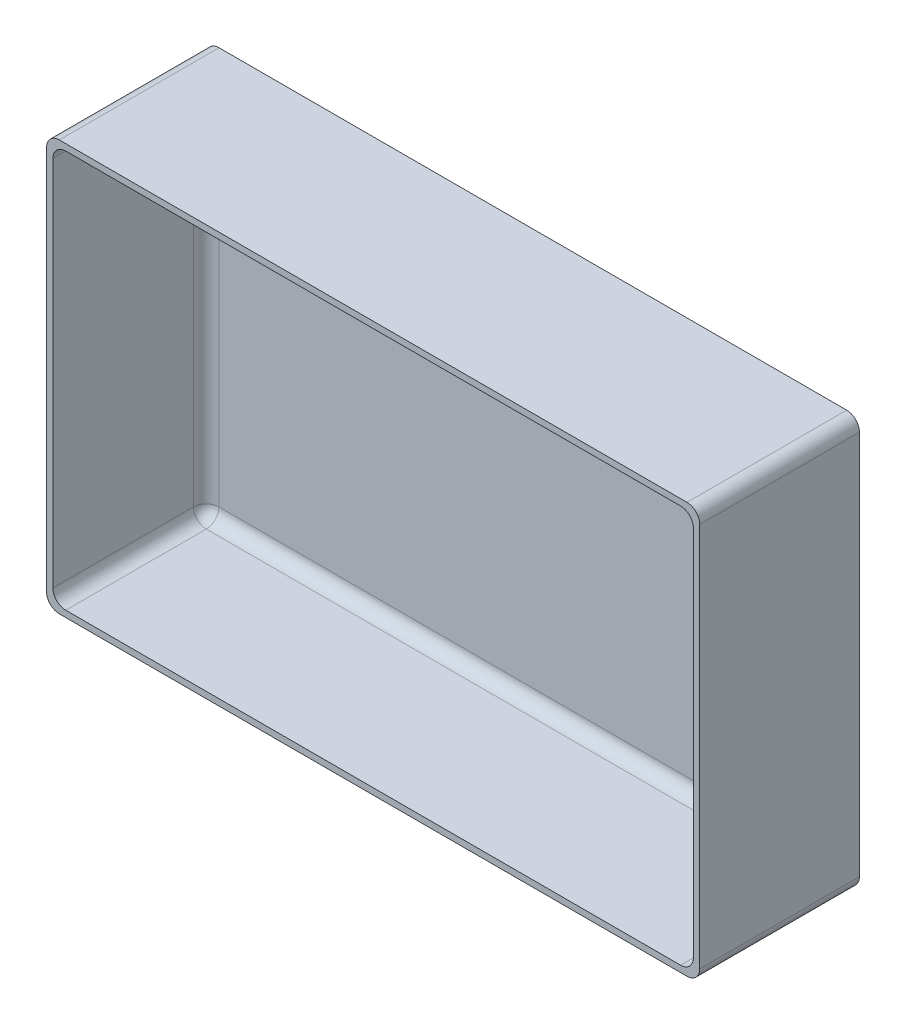
ISO-10303-21;
HEADER;
FILE_DESCRIPTION(('STEP AP214'),'2;1');
FILE_NAME('part.step','',(''),(''),'','','');
FILE_SCHEMA(('AUTOMOTIVE_DESIGN { 1 0 10303 214 1 1 1 1 }'));
ENDSEC;
DATA;
#1=APPLICATION_CONTEXT('core data for automotive mechanical design processes');
#2=APPLICATION_PROTOCOL_DEFINITION('international standard','automotive_design',2000,#1);
#3=PRODUCT_CONTEXT('',#1,'mechanical');
#4=PRODUCT('Part','Part','',(#3));
#5=PRODUCT_RELATED_PRODUCT_CATEGORY('part','',(#4));
#6=PRODUCT_DEFINITION_FORMATION('','',#4);
#7=PRODUCT_DEFINITION_CONTEXT('part definition',#1,'design');
#8=PRODUCT_DEFINITION('design','',#6,#7);
#9=PRODUCT_DEFINITION_SHAPE('','',#8);
#10=(LENGTH_UNIT() NAMED_UNIT(*) SI_UNIT(.MILLI.,.METRE.));
#11=(NAMED_UNIT(*) PLANE_ANGLE_UNIT() SI_UNIT($,.RADIAN.));
#12=(NAMED_UNIT(*) SI_UNIT($,.STERADIAN.) SOLID_ANGLE_UNIT());
#13=UNCERTAINTY_MEASURE_WITH_UNIT(LENGTH_MEASURE(1.E-05),#10,'distance_accuracy_value','');
#14=(GEOMETRIC_REPRESENTATION_CONTEXT(3) GLOBAL_UNCERTAINTY_ASSIGNED_CONTEXT((#13)) GLOBAL_UNIT_ASSIGNED_CONTEXT((#10,
#11,#12)) REPRESENTATION_CONTEXT('',''));
#15=CARTESIAN_POINT('',(0.,0.,0.));
#16=DIRECTION('',(0.,0.,1.));
#17=DIRECTION('',(1.,0.,0.));
#18=AXIS2_PLACEMENT_3D('',#15,#16,#17);
#19=CARTESIAN_POINT('',(40.9,25.7,20.));
#20=DIRECTION('',(-1.,0.,0.));
#21=DIRECTION('',(0.,0.,1.));
#22=AXIS2_PLACEMENT_3D('',#19,#20,#21);
#23=PLANE('',#22);
#24=DIRECTION('',(0.,1.,0.));
#25=VECTOR('',#24,1.);
#26=CARTESIAN_POINT('',(40.9,25.7,20.));
#27=LINE('',#26,#25);
#28=CARTESIAN_POINT('',(40.9,-24.1,20.));
#29=VERTEX_POINT('',#28);
#30=CARTESIAN_POINT('',(40.9,24.1,20.));
#31=VERTEX_POINT('',#30);
#32=EDGE_CURVE('E178',#29,#31,#27,.T.);
#33=ORIENTED_EDGE('',*,*,#32,.F.);
#34=DIRECTION('',(0.,0.,-1.));
#35=VECTOR('',#34,1.);
#36=CARTESIAN_POINT('',(40.9,-24.1,20.));
#37=LINE('',#36,#35);
#38=CARTESIAN_POINT('',(40.9,-24.1,0.));
#39=VERTEX_POINT('',#38);
#40=EDGE_CURVE('E163',#29,#39,#37,.T.);
#41=ORIENTED_EDGE('',*,*,#40,.T.);
#42=DIRECTION('',(0.,1.,0.));
#43=VECTOR('',#42,1.);
#44=CARTESIAN_POINT('',(40.9,25.7,0.));
#45=LINE('',#44,#43);
#46=CARTESIAN_POINT('',(40.9,24.1,0.));
#47=VERTEX_POINT('',#46);
#48=EDGE_CURVE('E175',#39,#47,#45,.T.);
#49=ORIENTED_EDGE('',*,*,#48,.T.);
#50=DIRECTION('',(0.,0.,-1.));
#51=VECTOR('',#50,1.);
#52=CARTESIAN_POINT('',(40.9,24.1,20.));
#53=LINE('',#52,#51);
#54=EDGE_CURVE('E180',#47,#31,#53,.F.);
#55=ORIENTED_EDGE('',*,*,#54,.T.);
#56=EDGE_LOOP('',(#33,#41,#49,#55));
#57=FACE_BOUND('',#56,.T.);
#58=ADVANCED_FACE('F33',(#57),#23,.F.);
#59=CARTESIAN_POINT('',(-40.9,25.7,20.));
#60=DIRECTION('',(0.,-1.,0.));
#61=DIRECTION('',(0.,0.,-1.));
#62=AXIS2_PLACEMENT_3D('',#59,#60,#61);
#63=PLANE('',#62);
#64=DIRECTION('',(-1.,0.,0.));
#65=VECTOR('',#64,1.);
#66=CARTESIAN_POINT('',(-40.9,25.7,0.));
#67=LINE('',#66,#65);
#68=CARTESIAN_POINT('',(39.3,25.7,0.));
#69=VERTEX_POINT('',#68);
#70=CARTESIAN_POINT('',(-39.3,25.7,0.));
#71=VERTEX_POINT('',#70);
#72=EDGE_CURVE('E185',#69,#71,#67,.T.);
#73=ORIENTED_EDGE('',*,*,#72,.T.);
#74=DIRECTION('',(0.,0.,-1.));
#75=VECTOR('',#74,1.);
#76=CARTESIAN_POINT('',(-39.3,25.7,20.));
#77=LINE('',#76,#75);
#78=CARTESIAN_POINT('',(-39.3,25.7,20.));
#79=VERTEX_POINT('',#78);
#80=EDGE_CURVE('E225',#71,#79,#77,.F.);
#81=ORIENTED_EDGE('',*,*,#80,.T.);
#82=DIRECTION('',(-1.,0.,0.));
#83=VECTOR('',#82,1.);
#84=CARTESIAN_POINT('',(-40.9,25.7,20.));
#85=LINE('',#84,#83);
#86=CARTESIAN_POINT('',(39.3,25.7,20.));
#87=VERTEX_POINT('',#86);
#88=EDGE_CURVE('E310',#87,#79,#85,.T.);
#89=ORIENTED_EDGE('',*,*,#88,.F.);
#90=DIRECTION('',(0.,0.,-1.));
#91=VECTOR('',#90,1.);
#92=CARTESIAN_POINT('',(39.3,25.7,20.));
#93=LINE('',#92,#91);
#94=EDGE_CURVE('E222',#87,#69,#93,.T.);
#95=ORIENTED_EDGE('',*,*,#94,.T.);
#96=EDGE_LOOP('',(#73,#81,#89,#95));
#97=FACE_BOUND('',#96,.T.);
#98=ADVANCED_FACE('F335',(#97),#63,.F.);
#99=CARTESIAN_POINT('',(-40.9,25.7,20.));
#100=DIRECTION('',(1.,0.,0.));
#101=DIRECTION('',(0.,1.,0.));
#102=AXIS2_PLACEMENT_3D('',#99,#100,#101);
#103=PLANE('',#102);
#104=DIRECTION('',(0.,-1.,0.));
#105=VECTOR('',#104,1.);
#106=CARTESIAN_POINT('',(-40.9,25.7,20.));
#107=LINE('',#106,#105);
#108=CARTESIAN_POINT('',(-40.9,24.1,20.));
#109=VERTEX_POINT('',#108);
#110=CARTESIAN_POINT('',(-40.9,-24.1,20.));
#111=VERTEX_POINT('',#110);
#112=EDGE_CURVE('E312',#109,#111,#107,.T.);
#113=ORIENTED_EDGE('',*,*,#112,.F.);
#114=DIRECTION('',(0.,0.,-1.));
#115=VECTOR('',#114,1.);
#116=CARTESIAN_POINT('',(-40.9,24.1,20.));
#117=LINE('',#116,#115);
#118=CARTESIAN_POINT('',(-40.9,24.1,0.));
#119=VERTEX_POINT('',#118);
#120=EDGE_CURVE('E219',#109,#119,#117,.T.);
#121=ORIENTED_EDGE('',*,*,#120,.T.);
#122=DIRECTION('',(0.,-1.,0.));
#123=VECTOR('',#122,1.);
#124=CARTESIAN_POINT('',(-40.9,25.7,0.));
#125=LINE('',#124,#123);
#126=CARTESIAN_POINT('',(-40.9,-24.1,0.));
#127=VERTEX_POINT('',#126);
#128=EDGE_CURVE('E189',#119,#127,#125,.T.);
#129=ORIENTED_EDGE('',*,*,#128,.T.);
#130=DIRECTION('',(0.,0.,-1.));
#131=VECTOR('',#130,1.);
#132=CARTESIAN_POINT('',(-40.9,-24.1,20.));
#133=LINE('',#132,#131);
#134=EDGE_CURVE('E217',#127,#111,#133,.F.);
#135=ORIENTED_EDGE('',*,*,#134,.T.);
#136=EDGE_LOOP('',(#113,#121,#129,#135));
#137=FACE_BOUND('',#136,.T.);
#138=ADVANCED_FACE('F328',(#137),#103,.F.);
#139=CARTESIAN_POINT('',(-40.9,-25.7,20.));
#140=DIRECTION('',(0.,1.,0.));
#141=DIRECTION('',(0.,0.,1.));
#142=AXIS2_PLACEMENT_3D('',#139,#140,#141);
#143=PLANE('',#142);
#144=DIRECTION('',(1.,0.,0.));
#145=VECTOR('',#144,1.);
#146=CARTESIAN_POINT('',(-40.9,-25.7,0.));
#147=LINE('',#146,#145);
#148=CARTESIAN_POINT('',(-39.3,-25.7,0.));
#149=VERTEX_POINT('',#148);
#150=CARTESIAN_POINT('',(39.3,-25.7,0.));
#151=VERTEX_POINT('',#150);
#152=EDGE_CURVE('E200',#149,#151,#147,.T.);
#153=ORIENTED_EDGE('',*,*,#152,.T.);
#154=DIRECTION('',(0.,0.,-1.));
#155=VECTOR('',#154,1.);
#156=CARTESIAN_POINT('',(39.3,-25.7,20.));
#157=LINE('',#156,#155);
#158=CARTESIAN_POINT('',(39.3,-25.7,20.));
#159=VERTEX_POINT('',#158);
#160=EDGE_CURVE('E164',#151,#159,#157,.F.);
#161=ORIENTED_EDGE('',*,*,#160,.T.);
#162=DIRECTION('',(1.,0.,0.));
#163=VECTOR('',#162,1.);
#164=CARTESIAN_POINT('',(-40.9,-25.7,20.));
#165=LINE('',#164,#163);
#166=CARTESIAN_POINT('',(-39.3,-25.7,20.));
#167=VERTEX_POINT('',#166);
#168=EDGE_CURVE('E195',#167,#159,#165,.T.);
#169=ORIENTED_EDGE('',*,*,#168,.F.);
#170=DIRECTION('',(0.,0.,-1.));
#171=VECTOR('',#170,1.);
#172=CARTESIAN_POINT('',(-39.3,-25.7,20.));
#173=LINE('',#172,#171);
#174=EDGE_CURVE('E169',#167,#149,#173,.T.);
#175=ORIENTED_EDGE('',*,*,#174,.T.);
#176=EDGE_LOOP('',(#153,#161,#169,#175));
#177=FACE_BOUND('',#176,.T.);
#178=ADVANCED_FACE('F322',(#177),#143,.F.);
#179=CARTESIAN_POINT('',(0.,0.,20.));
#180=DIRECTION('',(0.,0.,1.));
#181=DIRECTION('',(1.,0.,0.));
#182=AXIS2_PLACEMENT_3D('',#179,#180,#181);
#183=PLANE('',#182);
#184=DIRECTION('',(0.,1.,0.));
#185=VECTOR('',#184,1.);
#186=CARTESIAN_POINT('',(40.1,25.7,20.));
#187=LINE('',#186,#185);
#188=CARTESIAN_POINT('',(40.1,-23.3,20.));
#189=VERTEX_POINT('',#188);
#190=CARTESIAN_POINT('',(40.1,23.3,20.));
#191=VERTEX_POINT('',#190);
#192=EDGE_CURVE('E297',#189,#191,#187,.T.);
#193=ORIENTED_EDGE('',*,*,#192,.F.);
#194=CARTESIAN_POINT('',(38.5,-23.3,20.));
#195=DIRECTION('',(0.,0.,1.));
#196=DIRECTION('',(1.,0.,0.));
#197=AXIS2_PLACEMENT_3D('',#194,#195,#196);
#198=CIRCLE('',#197,1.6);
#199=CARTESIAN_POINT('',(38.5,-24.9,20.));
#200=VERTEX_POINT('',#199);
#201=EDGE_CURVE('E259',#189,#200,#198,.F.);
#202=ORIENTED_EDGE('',*,*,#201,.T.);
#203=DIRECTION('',(1.,0.,0.));
#204=VECTOR('',#203,1.);
#205=CARTESIAN_POINT('',(-40.9,-24.9,20.));
#206=LINE('',#205,#204);
#207=CARTESIAN_POINT('',(-38.5,-24.9,20.));
#208=VERTEX_POINT('',#207);
#209=EDGE_CURVE('E186',#208,#200,#206,.T.);
#210=ORIENTED_EDGE('',*,*,#209,.F.);
#211=CARTESIAN_POINT('',(-38.5,-23.3,20.));
#212=DIRECTION('',(0.,0.,1.));
#213=DIRECTION('',(1.,0.,0.));
#214=AXIS2_PLACEMENT_3D('',#211,#212,#213);
#215=CIRCLE('',#214,1.6);
#216=CARTESIAN_POINT('',(-40.1,-23.3,20.));
#217=VERTEX_POINT('',#216);
#218=EDGE_CURVE('E261',#208,#217,#215,.F.);
#219=ORIENTED_EDGE('',*,*,#218,.T.);
#220=DIRECTION('',(0.,-1.,0.));
#221=VECTOR('',#220,1.);
#222=CARTESIAN_POINT('',(-40.1,25.7,20.));
#223=LINE('',#222,#221);
#224=CARTESIAN_POINT('',(-40.1,23.3,20.));
#225=VERTEX_POINT('',#224);
#226=EDGE_CURVE('E192',#225,#217,#223,.T.);
#227=ORIENTED_EDGE('',*,*,#226,.F.);
#228=CARTESIAN_POINT('',(-38.5,23.3,20.));
#229=DIRECTION('',(0.,0.,1.));
#230=DIRECTION('',(1.,0.,0.));
#231=AXIS2_PLACEMENT_3D('',#228,#229,#230);
#232=CIRCLE('',#231,1.6);
#233=CARTESIAN_POINT('',(-38.5,24.9,20.));
#234=VERTEX_POINT('',#233);
#235=EDGE_CURVE('E11',#225,#234,#232,.F.);
#236=ORIENTED_EDGE('',*,*,#235,.T.);
#237=DIRECTION('',(-1.,0.,0.));
#238=VECTOR('',#237,1.);
#239=CARTESIAN_POINT('',(-40.9,24.9,20.));
#240=LINE('',#239,#238);
#241=CARTESIAN_POINT('',(38.5,24.9,20.));
#242=VERTEX_POINT('',#241);
#243=EDGE_CURVE('E300',#242,#234,#240,.T.);
#244=ORIENTED_EDGE('',*,*,#243,.F.);
#245=CARTESIAN_POINT('',(38.5,23.3,20.));
#246=DIRECTION('',(0.,0.,1.));
#247=DIRECTION('',(1.,0.,0.));
#248=AXIS2_PLACEMENT_3D('',#245,#246,#247);
#249=CIRCLE('',#248,1.6);
#250=EDGE_CURVE('E42',#242,#191,#249,.F.);
#251=ORIENTED_EDGE('',*,*,#250,.T.);
#252=EDGE_LOOP('',(#193,#202,#210,#219,#227,#236,#244,#251));
#253=FACE_BOUND('',#252,.T.);
#254=ORIENTED_EDGE('',*,*,#168,.T.);
#255=CARTESIAN_POINT('',(39.3,-24.1,20.));
#256=DIRECTION('',(0.,0.,1.));
#257=DIRECTION('',(1.,0.,0.));
#258=AXIS2_PLACEMENT_3D('',#255,#256,#257);
#259=CIRCLE('',#258,1.6);
#260=EDGE_CURVE('E215',#159,#29,#259,.T.);
#261=ORIENTED_EDGE('',*,*,#260,.T.);
#262=ORIENTED_EDGE('',*,*,#32,.T.);
#263=CARTESIAN_POINT('',(39.3,24.1,20.));
#264=DIRECTION('',(0.,0.,1.));
#265=DIRECTION('',(1.,0.,0.));
#266=AXIS2_PLACEMENT_3D('',#263,#264,#265);
#267=CIRCLE('',#266,1.6);
#268=EDGE_CURVE('E211',#31,#87,#267,.T.);
#269=ORIENTED_EDGE('',*,*,#268,.T.);
#270=ORIENTED_EDGE('',*,*,#88,.T.);
#271=CARTESIAN_POINT('',(-39.3,24.1,20.));
#272=DIRECTION('',(0.,0.,1.));
#273=DIRECTION('',(1.,0.,0.));
#274=AXIS2_PLACEMENT_3D('',#271,#272,#273);
#275=CIRCLE('',#274,1.6);
#276=EDGE_CURVE('E213',#79,#109,#275,.T.);
#277=ORIENTED_EDGE('',*,*,#276,.T.);
#278=ORIENTED_EDGE('',*,*,#112,.T.);
#279=CARTESIAN_POINT('',(-39.3,-24.1,20.));
#280=DIRECTION('',(0.,0.,1.));
#281=DIRECTION('',(1.,0.,0.));
#282=AXIS2_PLACEMENT_3D('',#279,#280,#281);
#283=CIRCLE('',#282,1.6);
#284=EDGE_CURVE('E209',#111,#167,#283,.T.);
#285=ORIENTED_EDGE('',*,*,#284,.T.);
#286=EDGE_LOOP('',(#254,#261,#262,#269,#270,#277,#278,#285));
#287=FACE_BOUND('',#286,.T.);
#288=ADVANCED_FACE('F319',(#253,#287),#183,.T.);
#289=CARTESIAN_POINT('',(0.,0.,0.));
#290=DIRECTION('',(0.,0.,1.));
#291=DIRECTION('',(1.,0.,0.));
#292=AXIS2_PLACEMENT_3D('',#289,#290,#291);
#293=PLANE('',#292);
#294=ORIENTED_EDGE('',*,*,#48,.F.);
#295=CARTESIAN_POINT('',(39.3,-24.1,0.));
#296=DIRECTION('',(0.,0.,1.));
#297=DIRECTION('',(1.,0.,0.));
#298=AXIS2_PLACEMENT_3D('',#295,#296,#297);
#299=CIRCLE('',#298,1.6);
#300=EDGE_CURVE('E159',#39,#151,#299,.F.);
#301=ORIENTED_EDGE('',*,*,#300,.T.);
#302=ORIENTED_EDGE('',*,*,#152,.F.);
#303=CARTESIAN_POINT('',(-39.3,-24.1,0.));
#304=DIRECTION('',(0.,0.,1.));
#305=DIRECTION('',(1.,0.,0.));
#306=AXIS2_PLACEMENT_3D('',#303,#304,#305);
#307=CIRCLE('',#306,1.6);
#308=EDGE_CURVE('E179',#149,#127,#307,.F.);
#309=ORIENTED_EDGE('',*,*,#308,.T.);
#310=ORIENTED_EDGE('',*,*,#128,.F.);
#311=CARTESIAN_POINT('',(-39.3,24.1,0.));
#312=DIRECTION('',(0.,0.,1.));
#313=DIRECTION('',(1.,0.,0.));
#314=AXIS2_PLACEMENT_3D('',#311,#312,#313);
#315=CIRCLE('',#314,1.6);
#316=EDGE_CURVE('E170',#119,#71,#315,.F.);
#317=ORIENTED_EDGE('',*,*,#316,.T.);
#318=ORIENTED_EDGE('',*,*,#72,.F.);
#319=CARTESIAN_POINT('',(39.3,24.1,0.));
#320=DIRECTION('',(0.,0.,1.));
#321=DIRECTION('',(1.,0.,0.));
#322=AXIS2_PLACEMENT_3D('',#319,#320,#321);
#323=CIRCLE('',#322,1.6);
#324=EDGE_CURVE('E184',#69,#47,#323,.F.);
#325=ORIENTED_EDGE('',*,*,#324,.T.);
#326=EDGE_LOOP('',(#294,#301,#302,#309,#310,#317,#318,#325));
#327=FACE_BOUND('',#326,.T.);
#328=ADVANCED_FACE('F182',(#327),#293,.F.);
#329=CARTESIAN_POINT('',(40.1,25.7,20.));
#330=DIRECTION('',(-1.,0.,0.));
#331=DIRECTION('',(0.,0.,1.));
#332=AXIS2_PLACEMENT_3D('',#329,#330,#331);
#333=PLANE('',#332);
#334=DIRECTION('',(0.,1.,0.));
#335=VECTOR('',#334,1.);
#336=CARTESIAN_POINT('',(40.1,-24.9,2.4));
#337=LINE('',#336,#335);
#338=CARTESIAN_POINT('',(40.1,23.3,2.4));
#339=VERTEX_POINT('',#338);
#340=CARTESIAN_POINT('',(40.1,-23.3,2.4));
#341=VERTEX_POINT('',#340);
#342=EDGE_CURVE('E238',#339,#341,#337,.F.);
#343=ORIENTED_EDGE('',*,*,#342,.T.);
#344=DIRECTION('',(0.,0.,-1.));
#345=VECTOR('',#344,1.);
#346=CARTESIAN_POINT('',(40.1,-23.3,20.));
#347=LINE('',#346,#345);
#348=EDGE_CURVE('E241',#341,#189,#347,.F.);
#349=ORIENTED_EDGE('',*,*,#348,.T.);
#350=ORIENTED_EDGE('',*,*,#192,.T.);
#351=DIRECTION('',(0.,0.,-1.));
#352=VECTOR('',#351,1.);
#353=CARTESIAN_POINT('',(40.1,23.3,0.799999999999999));
#354=LINE('',#353,#352);
#355=EDGE_CURVE('E236',#191,#339,#354,.T.);
#356=ORIENTED_EDGE('',*,*,#355,.T.);
#357=EDGE_LOOP('',(#343,#349,#350,#356));
#358=FACE_BOUND('',#357,.T.);
#359=ADVANCED_FACE('F378',(#358),#333,.T.);
#360=CARTESIAN_POINT('',(-40.9,24.9,20.));
#361=DIRECTION('',(0.,-1.,0.));
#362=DIRECTION('',(0.,0.,-1.));
#363=AXIS2_PLACEMENT_3D('',#360,#361,#362);
#364=PLANE('',#363);
#365=DIRECTION('',(-1.,0.,0.));
#366=VECTOR('',#365,1.);
#367=CARTESIAN_POINT('',(40.1,24.9,2.4));
#368=LINE('',#367,#366);
#369=CARTESIAN_POINT('',(-38.5,24.9,2.4));
#370=VERTEX_POINT('',#369);
#371=CARTESIAN_POINT('',(38.5,24.9,2.4));
#372=VERTEX_POINT('',#371);
#373=EDGE_CURVE('E50',#370,#372,#368,.F.);
#374=ORIENTED_EDGE('',*,*,#373,.T.);
#375=DIRECTION('',(0.,0.,-1.));
#376=VECTOR('',#375,1.);
#377=CARTESIAN_POINT('',(38.5,24.9,20.));
#378=LINE('',#377,#376);
#379=EDGE_CURVE('E257',#372,#242,#378,.F.);
#380=ORIENTED_EDGE('',*,*,#379,.T.);
#381=ORIENTED_EDGE('',*,*,#243,.T.);
#382=DIRECTION('',(0.,0.,-1.));
#383=VECTOR('',#382,1.);
#384=CARTESIAN_POINT('',(-38.5,24.9,0.799999999999999));
#385=LINE('',#384,#383);
#386=EDGE_CURVE('E55',#234,#370,#385,.T.);
#387=ORIENTED_EDGE('',*,*,#386,.T.);
#388=EDGE_LOOP('',(#374,#380,#381,#387));
#389=FACE_BOUND('',#388,.T.);
#390=ADVANCED_FACE('F403',(#389),#364,.T.);
#391=CARTESIAN_POINT('',(-40.1,25.7,20.));
#392=DIRECTION('',(1.,0.,0.));
#393=DIRECTION('',(0.,1.,0.));
#394=AXIS2_PLACEMENT_3D('',#391,#392,#393);
#395=PLANE('',#394);
#396=ORIENTED_EDGE('',*,*,#226,.T.);
#397=DIRECTION('',(0.,0.,-1.));
#398=VECTOR('',#397,1.);
#399=CARTESIAN_POINT('',(-40.1,-23.3,0.799999999999999));
#400=LINE('',#399,#398);
#401=CARTESIAN_POINT('',(-40.1,-23.3,2.4));
#402=VERTEX_POINT('',#401);
#403=EDGE_CURVE('E247',#217,#402,#400,.T.);
#404=ORIENTED_EDGE('',*,*,#403,.T.);
#405=DIRECTION('',(0.,-1.,0.));
#406=VECTOR('',#405,1.);
#407=CARTESIAN_POINT('',(-40.1,24.9,2.4));
#408=LINE('',#407,#406);
#409=CARTESIAN_POINT('',(-40.1,23.3,2.4));
#410=VERTEX_POINT('',#409);
#411=EDGE_CURVE('E245',#402,#410,#408,.F.);
#412=ORIENTED_EDGE('',*,*,#411,.T.);
#413=DIRECTION('',(0.,0.,-1.));
#414=VECTOR('',#413,1.);
#415=CARTESIAN_POINT('',(-40.1,23.3,20.));
#416=LINE('',#415,#414);
#417=EDGE_CURVE('E243',#410,#225,#416,.F.);
#418=ORIENTED_EDGE('',*,*,#417,.T.);
#419=EDGE_LOOP('',(#396,#404,#412,#418));
#420=FACE_BOUND('',#419,.T.);
#421=ADVANCED_FACE('F368',(#420),#395,.T.);
#422=CARTESIAN_POINT('',(-40.9,-24.9,20.));
#423=DIRECTION('',(0.,1.,0.));
#424=DIRECTION('',(0.,0.,1.));
#425=AXIS2_PLACEMENT_3D('',#422,#423,#424);
#426=PLANE('',#425);
#427=ORIENTED_EDGE('',*,*,#209,.T.);
#428=DIRECTION('',(0.,0.,-1.));
#429=VECTOR('',#428,1.);
#430=CARTESIAN_POINT('',(38.5,-24.9,0.799999999999999));
#431=LINE('',#430,#429);
#432=CARTESIAN_POINT('',(38.5,-24.9,2.4));
#433=VERTEX_POINT('',#432);
#434=EDGE_CURVE('E253',#200,#433,#431,.T.);
#435=ORIENTED_EDGE('',*,*,#434,.T.);
#436=DIRECTION('',(1.,0.,0.));
#437=VECTOR('',#436,1.);
#438=CARTESIAN_POINT('',(-40.1,-24.9,2.4));
#439=LINE('',#438,#437);
#440=CARTESIAN_POINT('',(-38.5,-24.9,2.4));
#441=VERTEX_POINT('',#440);
#442=EDGE_CURVE('E251',#433,#441,#439,.F.);
#443=ORIENTED_EDGE('',*,*,#442,.T.);
#444=DIRECTION('',(0.,0.,-1.));
#445=VECTOR('',#444,1.);
#446=CARTESIAN_POINT('',(-38.5,-24.9,20.));
#447=LINE('',#446,#445);
#448=EDGE_CURVE('E249',#441,#208,#447,.F.);
#449=ORIENTED_EDGE('',*,*,#448,.T.);
#450=EDGE_LOOP('',(#427,#435,#443,#449));
#451=FACE_BOUND('',#450,.T.);
#452=ADVANCED_FACE('F362',(#451),#426,.T.);
#453=CARTESIAN_POINT('',(0.,0.,0.8));
#454=DIRECTION('',(0.,0.,1.));
#455=DIRECTION('',(1.,0.,0.));
#456=AXIS2_PLACEMENT_3D('',#453,#454,#455);
#457=PLANE('',#456);
#458=DIRECTION('',(0.,-1.,0.));
#459=VECTOR('',#458,1.);
#460=CARTESIAN_POINT('',(-38.5,-24.9,0.8));
#461=LINE('',#460,#459);
#462=CARTESIAN_POINT('',(-38.5,23.3,0.8));
#463=VERTEX_POINT('',#462);
#464=CARTESIAN_POINT('',(-38.5,-23.3,0.8));
#465=VERTEX_POINT('',#464);
#466=EDGE_CURVE('E229',#463,#465,#461,.T.);
#467=ORIENTED_EDGE('',*,*,#466,.T.);
#468=DIRECTION('',(1.,0.,0.));
#469=VECTOR('',#468,1.);
#470=CARTESIAN_POINT('',(40.1,-23.3,0.8));
#471=LINE('',#470,#469);
#472=CARTESIAN_POINT('',(38.5,-23.3,0.8));
#473=VERTEX_POINT('',#472);
#474=EDGE_CURVE('E234',#465,#473,#471,.T.);
#475=ORIENTED_EDGE('',*,*,#474,.T.);
#476=DIRECTION('',(0.,1.,0.));
#477=VECTOR('',#476,1.);
#478=CARTESIAN_POINT('',(38.5,24.9,0.8));
#479=LINE('',#478,#477);
#480=CARTESIAN_POINT('',(38.5,23.3,0.8));
#481=VERTEX_POINT('',#480);
#482=EDGE_CURVE('E231',#473,#481,#479,.T.);
#483=ORIENTED_EDGE('',*,*,#482,.T.);
#484=DIRECTION('',(-1.,0.,0.));
#485=VECTOR('',#484,1.);
#486=CARTESIAN_POINT('',(-40.1,23.3,0.8));
#487=LINE('',#486,#485);
#488=EDGE_CURVE('E227',#481,#463,#487,.T.);
#489=ORIENTED_EDGE('',*,*,#488,.T.);
#490=EDGE_LOOP('',(#467,#475,#483,#489));
#491=FACE_BOUND('',#490,.T.);
#492=ADVANCED_FACE('F358',(#491),#457,.T.);
#493=CARTESIAN_POINT('',(39.3,-24.1,20.));
#494=DIRECTION('',(0.,0.,-1.));
#495=DIRECTION('',(-1.,0.,0.));
#496=AXIS2_PLACEMENT_3D('',#493,#494,#495);
#497=CYLINDRICAL_SURFACE('',#496,1.6);
#498=ORIENTED_EDGE('',*,*,#260,.F.);
#499=ORIENTED_EDGE('',*,*,#160,.F.);
#500=ORIENTED_EDGE('',*,*,#300,.F.);
#501=ORIENTED_EDGE('',*,*,#40,.F.);
#502=EDGE_LOOP('',(#498,#499,#500,#501));
#503=FACE_BOUND('',#502,.T.);
#504=ADVANCED_FACE('F162',(#503),#497,.T.);
#505=CARTESIAN_POINT('',(-39.3,24.1,20.));
#506=DIRECTION('',(0.,0.,-1.));
#507=DIRECTION('',(-1.,0.,0.));
#508=AXIS2_PLACEMENT_3D('',#505,#506,#507);
#509=CYLINDRICAL_SURFACE('',#508,1.6);
#510=ORIENTED_EDGE('',*,*,#276,.F.);
#511=ORIENTED_EDGE('',*,*,#80,.F.);
#512=ORIENTED_EDGE('',*,*,#316,.F.);
#513=ORIENTED_EDGE('',*,*,#120,.F.);
#514=EDGE_LOOP('',(#510,#511,#512,#513));
#515=FACE_BOUND('',#514,.T.);
#516=ADVANCED_FACE('F332',(#515),#509,.T.);
#517=CARTESIAN_POINT('',(39.3,24.1,20.));
#518=DIRECTION('',(0.,0.,-1.));
#519=DIRECTION('',(-1.,0.,0.));
#520=AXIS2_PLACEMENT_3D('',#517,#518,#519);
#521=CYLINDRICAL_SURFACE('',#520,1.6);
#522=ORIENTED_EDGE('',*,*,#268,.F.);
#523=ORIENTED_EDGE('',*,*,#54,.F.);
#524=ORIENTED_EDGE('',*,*,#324,.F.);
#525=ORIENTED_EDGE('',*,*,#94,.F.);
#526=EDGE_LOOP('',(#522,#523,#524,#525));
#527=FACE_BOUND('',#526,.T.);
#528=ADVANCED_FACE('F340',(#527),#521,.T.);
#529=CARTESIAN_POINT('',(-39.3,-24.1,20.));
#530=DIRECTION('',(0.,0.,-1.));
#531=DIRECTION('',(-1.,0.,0.));
#532=AXIS2_PLACEMENT_3D('',#529,#530,#531);
#533=CYLINDRICAL_SURFACE('',#532,1.6);
#534=ORIENTED_EDGE('',*,*,#284,.F.);
#535=ORIENTED_EDGE('',*,*,#134,.F.);
#536=ORIENTED_EDGE('',*,*,#308,.F.);
#537=ORIENTED_EDGE('',*,*,#174,.F.);
#538=EDGE_LOOP('',(#534,#535,#536,#537));
#539=FACE_BOUND('',#538,.T.);
#540=ADVANCED_FACE('F324',(#539),#533,.T.);
#541=CARTESIAN_POINT('',(-38.5,-23.3,20.));
#542=DIRECTION('',(0.,0.,1.));
#543=DIRECTION('',(1.,0.,0.));
#544=AXIS2_PLACEMENT_3D('',#541,#542,#543);
#545=CYLINDRICAL_SURFACE('',#544,1.6);
#546=ORIENTED_EDGE('',*,*,#218,.F.);
#547=ORIENTED_EDGE('',*,*,#448,.F.);
#548=CARTESIAN_POINT('',(-38.5,-23.3,2.4));
#549=DIRECTION('',(0.,0.,1.));
#550=DIRECTION('',(1.,0.,0.));
#551=AXIS2_PLACEMENT_3D('',#548,#549,#550);
#552=CIRCLE('',#551,1.6);
#553=EDGE_CURVE('E37',#402,#441,#552,.T.);
#554=ORIENTED_EDGE('',*,*,#553,.F.);
#555=ORIENTED_EDGE('',*,*,#403,.F.);
#556=EDGE_LOOP('',(#546,#547,#554,#555));
#557=FACE_BOUND('',#556,.T.);
#558=ADVANCED_FACE('F35',(#557),#545,.F.);
#559=CARTESIAN_POINT('',(-38.5,0.,2.4));
#560=DIRECTION('',(0.,1.,0.));
#561=DIRECTION('',(-1.,0.,0.));
#562=AXIS2_PLACEMENT_3D('',#559,#560,#561);
#563=CYLINDRICAL_SURFACE('',#562,1.6);
#564=CARTESIAN_POINT('',(-38.5,23.3,2.4));
#565=DIRECTION('',(0.,-1.,0.));
#566=DIRECTION('',(0.,0.,-1.));
#567=AXIS2_PLACEMENT_3D('',#564,#565,#566);
#568=CIRCLE('',#567,1.6);
#569=EDGE_CURVE('E289',#410,#463,#568,.T.);
#570=ORIENTED_EDGE('',*,*,#569,.F.);
#571=ORIENTED_EDGE('',*,*,#411,.F.);
#572=CARTESIAN_POINT('',(-38.5,-23.3,2.4));
#573=DIRECTION('',(0.,1.,0.));
#574=DIRECTION('',(0.,0.,1.));
#575=AXIS2_PLACEMENT_3D('',#572,#573,#574);
#576=CIRCLE('',#575,1.6);
#577=EDGE_CURVE('E291',#465,#402,#576,.T.);
#578=ORIENTED_EDGE('',*,*,#577,.F.);
#579=ORIENTED_EDGE('',*,*,#466,.F.);
#580=EDGE_LOOP('',(#570,#571,#578,#579));
#581=FACE_BOUND('',#580,.T.);
#582=ADVANCED_FACE('F453',(#581),#563,.F.);
#583=CARTESIAN_POINT('',(-38.5,23.3,20.));
#584=DIRECTION('',(0.,0.,1.));
#585=DIRECTION('',(1.,0.,0.));
#586=AXIS2_PLACEMENT_3D('',#583,#584,#585);
#587=CYLINDRICAL_SURFACE('',#586,1.6);
#588=ORIENTED_EDGE('',*,*,#235,.F.);
#589=ORIENTED_EDGE('',*,*,#417,.F.);
#590=CARTESIAN_POINT('',(-38.5,23.3,2.4));
#591=DIRECTION('',(0.,0.,1.));
#592=DIRECTION('',(1.,0.,0.));
#593=AXIS2_PLACEMENT_3D('',#590,#591,#592);
#594=CIRCLE('',#593,1.6);
#595=EDGE_CURVE('E286',#370,#410,#594,.T.);
#596=ORIENTED_EDGE('',*,*,#595,.F.);
#597=ORIENTED_EDGE('',*,*,#386,.F.);
#598=EDGE_LOOP('',(#588,#589,#596,#597));
#599=FACE_BOUND('',#598,.T.);
#600=ADVANCED_FACE('F462',(#599),#587,.F.);
#601=CARTESIAN_POINT('',(-38.5,-23.3,2.4));
#602=DIRECTION('',(-1.,0.,0.));
#603=DIRECTION('',(0.,0.,1.));
#604=AXIS2_PLACEMENT_3D('',#601,#602,#603);
#605=SPHERICAL_SURFACE('',#604,1.6);
#606=ORIENTED_EDGE('',*,*,#577,.T.);
#607=ORIENTED_EDGE('',*,*,#553,.T.);
#608=CARTESIAN_POINT('',(-38.5,-23.3,2.4));
#609=DIRECTION('',(1.,0.,0.));
#610=DIRECTION('',(0.,0.,-1.));
#611=AXIS2_PLACEMENT_3D('',#608,#609,#610);
#612=CIRCLE('',#611,1.6);
#613=EDGE_CURVE('E283',#465,#441,#612,.F.);
#614=ORIENTED_EDGE('',*,*,#613,.F.);
#615=EDGE_LOOP('',(#606,#607,#614));
#616=FACE_BOUND('',#615,.T.);
#617=ADVANCED_FACE('F471',(#616),#605,.F.);
#618=CARTESIAN_POINT('',(-38.5,23.3,2.4));
#619=DIRECTION('',(-1.,0.,0.));
#620=DIRECTION('',(0.,0.,1.));
#621=AXIS2_PLACEMENT_3D('',#618,#619,#620);
#622=SPHERICAL_SURFACE('',#621,1.6);
#623=ORIENTED_EDGE('',*,*,#595,.T.);
#624=ORIENTED_EDGE('',*,*,#569,.T.);
#625=CARTESIAN_POINT('',(-38.5,23.3,2.4));
#626=DIRECTION('',(1.,0.,0.));
#627=DIRECTION('',(0.,0.,-1.));
#628=AXIS2_PLACEMENT_3D('',#625,#626,#627);
#629=CIRCLE('',#628,1.6);
#630=EDGE_CURVE('E280',#370,#463,#629,.F.);
#631=ORIENTED_EDGE('',*,*,#630,.F.);
#632=EDGE_LOOP('',(#623,#624,#631));
#633=FACE_BOUND('',#632,.T.);
#634=ADVANCED_FACE('F481',(#633),#622,.F.);
#635=CARTESIAN_POINT('',(38.5,-23.3,20.));
#636=DIRECTION('',(0.,0.,1.));
#637=DIRECTION('',(1.,0.,0.));
#638=AXIS2_PLACEMENT_3D('',#635,#636,#637);
#639=CYLINDRICAL_SURFACE('',#638,1.6);
#640=ORIENTED_EDGE('',*,*,#201,.F.);
#641=ORIENTED_EDGE('',*,*,#348,.F.);
#642=CARTESIAN_POINT('',(38.5,-23.3,2.4));
#643=DIRECTION('',(0.,0.,1.));
#644=DIRECTION('',(1.,0.,0.));
#645=AXIS2_PLACEMENT_3D('',#642,#643,#644);
#646=CIRCLE('',#645,1.6);
#647=EDGE_CURVE('E277',#433,#341,#646,.T.);
#648=ORIENTED_EDGE('',*,*,#647,.F.);
#649=ORIENTED_EDGE('',*,*,#434,.F.);
#650=EDGE_LOOP('',(#640,#641,#648,#649));
#651=FACE_BOUND('',#650,.T.);
#652=ADVANCED_FACE('F490',(#651),#639,.F.);
#653=CARTESIAN_POINT('',(0.,-23.3,2.4));
#654=DIRECTION('',(-1.,0.,0.));
#655=DIRECTION('',(0.,0.,1.));
#656=AXIS2_PLACEMENT_3D('',#653,#654,#655);
#657=CYLINDRICAL_SURFACE('',#656,1.6);
#658=ORIENTED_EDGE('',*,*,#613,.T.);
#659=ORIENTED_EDGE('',*,*,#442,.F.);
#660=CARTESIAN_POINT('',(38.5,-23.3,2.4));
#661=DIRECTION('',(-1.,0.,0.));
#662=DIRECTION('',(0.,0.,1.));
#663=AXIS2_PLACEMENT_3D('',#660,#661,#662);
#664=CIRCLE('',#663,1.6);
#665=EDGE_CURVE('E274',#473,#433,#664,.T.);
#666=ORIENTED_EDGE('',*,*,#665,.F.);
#667=ORIENTED_EDGE('',*,*,#474,.F.);
#668=EDGE_LOOP('',(#658,#659,#666,#667));
#669=FACE_BOUND('',#668,.T.);
#670=ADVANCED_FACE('F500',(#669),#657,.F.);
#671=CARTESIAN_POINT('',(0.,23.3,2.4));
#672=DIRECTION('',(1.,0.,0.));
#673=DIRECTION('',(0.,0.,-1.));
#674=AXIS2_PLACEMENT_3D('',#671,#672,#673);
#675=CYLINDRICAL_SURFACE('',#674,1.6);
#676=ORIENTED_EDGE('',*,*,#630,.T.);
#677=ORIENTED_EDGE('',*,*,#488,.F.);
#678=CARTESIAN_POINT('',(38.5,23.3,2.4));
#679=DIRECTION('',(-1.,0.,0.));
#680=DIRECTION('',(0.,0.,1.));
#681=AXIS2_PLACEMENT_3D('',#678,#679,#680);
#682=CIRCLE('',#681,1.6);
#683=EDGE_CURVE('E271',#372,#481,#682,.T.);
#684=ORIENTED_EDGE('',*,*,#683,.F.);
#685=ORIENTED_EDGE('',*,*,#373,.F.);
#686=EDGE_LOOP('',(#676,#677,#684,#685));
#687=FACE_BOUND('',#686,.T.);
#688=ADVANCED_FACE('F510',(#687),#675,.F.);
#689=CARTESIAN_POINT('',(38.5,23.3,20.));
#690=DIRECTION('',(0.,0.,1.));
#691=DIRECTION('',(1.,0.,0.));
#692=AXIS2_PLACEMENT_3D('',#689,#690,#691);
#693=CYLINDRICAL_SURFACE('',#692,1.6);
#694=ORIENTED_EDGE('',*,*,#250,.F.);
#695=ORIENTED_EDGE('',*,*,#379,.F.);
#696=CARTESIAN_POINT('',(38.5,23.3,2.4));
#697=DIRECTION('',(0.,0.,1.));
#698=DIRECTION('',(1.,0.,0.));
#699=AXIS2_PLACEMENT_3D('',#696,#697,#698);
#700=CIRCLE('',#699,1.6);
#701=EDGE_CURVE('E268',#339,#372,#700,.T.);
#702=ORIENTED_EDGE('',*,*,#701,.F.);
#703=ORIENTED_EDGE('',*,*,#355,.F.);
#704=EDGE_LOOP('',(#694,#695,#702,#703));
#705=FACE_BOUND('',#704,.T.);
#706=ADVANCED_FACE('F520',(#705),#693,.F.);
#707=CARTESIAN_POINT('',(38.5,-23.3,2.4));
#708=DIRECTION('',(0.,-1.,0.));
#709=DIRECTION('',(0.,0.,-1.));
#710=AXIS2_PLACEMENT_3D('',#707,#708,#709);
#711=SPHERICAL_SURFACE('',#710,1.6);
#712=ORIENTED_EDGE('',*,*,#665,.T.);
#713=ORIENTED_EDGE('',*,*,#647,.T.);
#714=CARTESIAN_POINT('',(38.5,-23.3,2.4));
#715=DIRECTION('',(0.,1.,0.));
#716=DIRECTION('',(0.,0.,1.));
#717=AXIS2_PLACEMENT_3D('',#714,#715,#716);
#718=CIRCLE('',#717,1.6);
#719=EDGE_CURVE('E266',#473,#341,#718,.F.);
#720=ORIENTED_EDGE('',*,*,#719,.F.);
#721=EDGE_LOOP('',(#712,#713,#720));
#722=FACE_BOUND('',#721,.T.);
#723=ADVANCED_FACE('F530',(#722),#711,.F.);
#724=CARTESIAN_POINT('',(38.5,23.3,2.4));
#725=DIRECTION('',(0.,1.,0.));
#726=DIRECTION('',(0.,0.,1.));
#727=AXIS2_PLACEMENT_3D('',#724,#725,#726);
#728=SPHERICAL_SURFACE('',#727,1.6);
#729=ORIENTED_EDGE('',*,*,#701,.T.);
#730=ORIENTED_EDGE('',*,*,#683,.T.);
#731=CARTESIAN_POINT('',(38.5,23.3,2.4));
#732=DIRECTION('',(0.,-1.,0.));
#733=DIRECTION('',(0.,0.,-1.));
#734=AXIS2_PLACEMENT_3D('',#731,#732,#733);
#735=CIRCLE('',#734,1.6);
#736=EDGE_CURVE('E264',#339,#481,#735,.F.);
#737=ORIENTED_EDGE('',*,*,#736,.F.);
#738=EDGE_LOOP('',(#729,#730,#737));
#739=FACE_BOUND('',#738,.T.);
#740=ADVANCED_FACE('F540',(#739),#728,.F.);
#741=CARTESIAN_POINT('',(38.5,0.,2.4));
#742=DIRECTION('',(0.,-1.,0.));
#743=DIRECTION('',(0.,0.,-1.));
#744=AXIS2_PLACEMENT_3D('',#741,#742,#743);
#745=CYLINDRICAL_SURFACE('',#744,1.6);
#746=ORIENTED_EDGE('',*,*,#719,.T.);
#747=ORIENTED_EDGE('',*,*,#342,.F.);
#748=ORIENTED_EDGE('',*,*,#736,.T.);
#749=ORIENTED_EDGE('',*,*,#482,.F.);
#750=EDGE_LOOP('',(#746,#747,#748,#749));
#751=FACE_BOUND('',#750,.T.);
#752=ADVANCED_FACE('F550',(#751),#745,.F.);
#753=CLOSED_SHELL('',(#58,#98,#138,#178,#288,#328,#359,#390,#421,#452,#492,#504,#516,#528,#540,
#558,#582,#600,#617,#634,#652,#670,#688,#706,#723,#740,#752));
#754=MANIFOLD_SOLID_BREP('B2',#753);
#755=ADVANCED_BREP_SHAPE_REPRESENTATION('',(#18,#754),#14);
#756=SHAPE_DEFINITION_REPRESENTATION(#9,#755);
ENDSEC;
END-ISO-10303-21;
